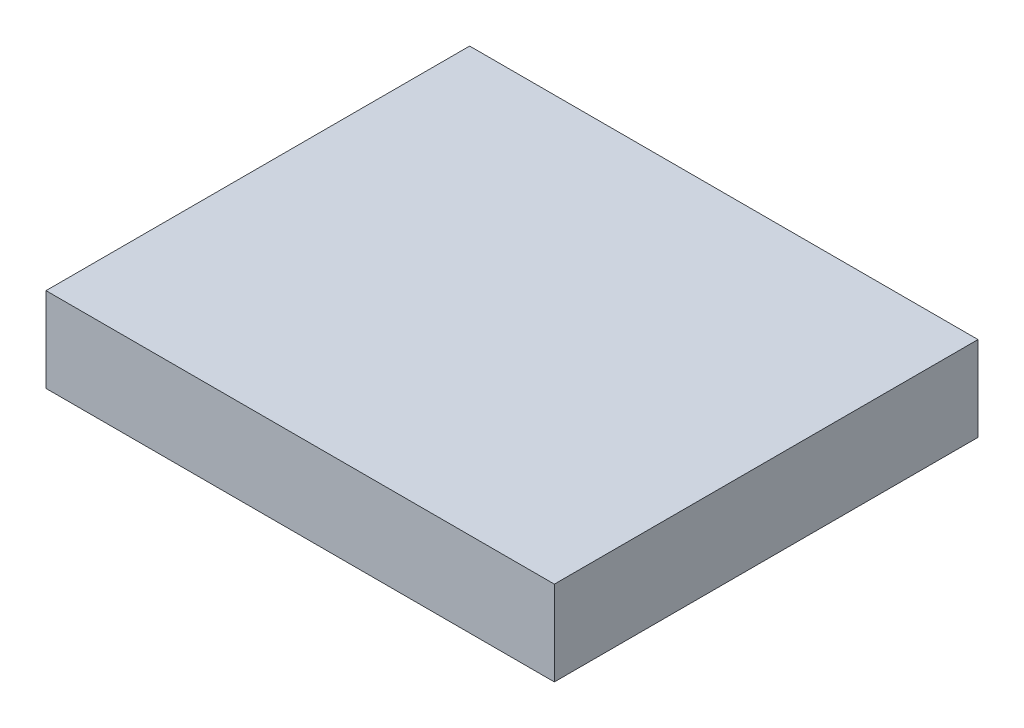
ISO-10303-21;
HEADER;
FILE_DESCRIPTION(('STEP AP214'),'2;1');
FILE_NAME('part.step','',(''),(''),'','','');
FILE_SCHEMA(('AUTOMOTIVE_DESIGN { 1 0 10303 214 1 1 1 1 }'));
ENDSEC;
DATA;
#1=APPLICATION_CONTEXT('core data for automotive mechanical design processes');
#2=APPLICATION_PROTOCOL_DEFINITION('international standard','automotive_design',2000,#1);
#3=PRODUCT_CONTEXT('',#1,'mechanical');
#4=PRODUCT('Part','Part','',(#3));
#5=PRODUCT_RELATED_PRODUCT_CATEGORY('part','',(#4));
#6=PRODUCT_DEFINITION_FORMATION('','',#4);
#7=PRODUCT_DEFINITION_CONTEXT('part definition',#1,'design');
#8=PRODUCT_DEFINITION('design','',#6,#7);
#9=PRODUCT_DEFINITION_SHAPE('','',#8);
#10=(LENGTH_UNIT() NAMED_UNIT(*) SI_UNIT(.MILLI.,.METRE.));
#11=(NAMED_UNIT(*) PLANE_ANGLE_UNIT() SI_UNIT($,.RADIAN.));
#12=(NAMED_UNIT(*) SI_UNIT($,.STERADIAN.) SOLID_ANGLE_UNIT());
#13=UNCERTAINTY_MEASURE_WITH_UNIT(LENGTH_MEASURE(1.E-05),#10,'distance_accuracy_value','');
#14=(GEOMETRIC_REPRESENTATION_CONTEXT(3) GLOBAL_UNCERTAINTY_ASSIGNED_CONTEXT((#13)) GLOBAL_UNIT_ASSIGNED_CONTEXT((#10,
#11,#12)) REPRESENTATION_CONTEXT('',''));
#15=CARTESIAN_POINT('',(0.,0.,0.));
#16=DIRECTION('',(0.,0.,1.));
#17=DIRECTION('',(1.,0.,0.));
#18=AXIS2_PLACEMENT_3D('',#15,#16,#17);
#19=CARTESIAN_POINT('',(0.3,0.28,0.25));
#20=DIRECTION('',(-1.,0.,0.));
#21=DIRECTION('',(0.,0.707106781186548,0.707106781186548));
#22=AXIS2_PLACEMENT_3D('',#19,#20,#21);
#23=PLANE('',#22);
#24=DIRECTION('',(0.,0.,-1.));
#25=VECTOR('',#24,1.);
#26=CARTESIAN_POINT('',(0.3,0.18,0.25));
#27=LINE('',#26,#25);
#28=CARTESIAN_POINT('',(0.3,0.18,0.25));
#29=VERTEX_POINT('',#28);
#30=CARTESIAN_POINT('',(0.3,0.18,-0.25));
#31=VERTEX_POINT('',#30);
#32=EDGE_CURVE('E11',#29,#31,#27,.T.);
#33=ORIENTED_EDGE('',*,*,#32,.T.);
#34=DIRECTION('',(0.,-1.,0.));
#35=VECTOR('',#34,1.);
#36=CARTESIAN_POINT('',(0.3,0.28,-0.25));
#37=LINE('',#36,#35);
#38=CARTESIAN_POINT('',(0.3,0.28,-0.25));
#39=VERTEX_POINT('',#38);
#40=EDGE_CURVE('E35',#39,#31,#37,.T.);
#41=ORIENTED_EDGE('',*,*,#40,.F.);
#42=DIRECTION('',(0.,0.,-1.));
#43=VECTOR('',#42,1.);
#44=CARTESIAN_POINT('',(0.3,0.28,0.25));
#45=LINE('',#44,#43);
#46=CARTESIAN_POINT('',(0.3,0.28,0.25));
#47=VERTEX_POINT('',#46);
#48=EDGE_CURVE('E72',#47,#39,#45,.T.);
#49=ORIENTED_EDGE('',*,*,#48,.F.);
#50=DIRECTION('',(0.,-1.,0.));
#51=VECTOR('',#50,1.);
#52=CARTESIAN_POINT('',(0.3,0.28,0.25));
#53=LINE('',#52,#51);
#54=EDGE_CURVE('E26',#47,#29,#53,.T.);
#55=ORIENTED_EDGE('',*,*,#54,.T.);
#56=EDGE_LOOP('',(#33,#41,#49,#55));
#57=FACE_BOUND('',#56,.T.);
#58=ADVANCED_FACE('F16',(#57),#23,.F.);
#59=CARTESIAN_POINT('',(-0.3,0.28,-0.25));
#60=DIRECTION('',(0.,0.,1.));
#61=DIRECTION('',(0.707106781186548,0.707106781186548,0.));
#62=AXIS2_PLACEMENT_3D('',#59,#60,#61);
#63=PLANE('',#62);
#64=DIRECTION('',(-1.,0.,0.));
#65=VECTOR('',#64,1.);
#66=CARTESIAN_POINT('',(-0.3,0.18,-0.25));
#67=LINE('',#66,#65);
#68=CARTESIAN_POINT('',(-0.3,0.18,-0.25));
#69=VERTEX_POINT('',#68);
#70=EDGE_CURVE('E79',#31,#69,#67,.T.);
#71=ORIENTED_EDGE('',*,*,#70,.T.);
#72=DIRECTION('',(0.,-1.,0.));
#73=VECTOR('',#72,1.);
#74=CARTESIAN_POINT('',(-0.3,0.28,-0.25));
#75=LINE('',#74,#73);
#76=CARTESIAN_POINT('',(-0.3,0.28,-0.25));
#77=VERTEX_POINT('',#76);
#78=EDGE_CURVE('E85',#77,#69,#75,.T.);
#79=ORIENTED_EDGE('',*,*,#78,.F.);
#80=DIRECTION('',(-1.,0.,0.));
#81=VECTOR('',#80,1.);
#82=CARTESIAN_POINT('',(-0.3,0.28,-0.25));
#83=LINE('',#82,#81);
#84=EDGE_CURVE('E63',#39,#77,#83,.T.);
#85=ORIENTED_EDGE('',*,*,#84,.F.);
#86=ORIENTED_EDGE('',*,*,#40,.T.);
#87=EDGE_LOOP('',(#71,#79,#85,#86));
#88=FACE_BOUND('',#87,.T.);
#89=ADVANCED_FACE('F89',(#88),#63,.F.);
#90=CARTESIAN_POINT('',(-0.3,0.28,0.25));
#91=DIRECTION('',(1.,0.,0.));
#92=DIRECTION('',(0.,0.707106781186548,0.707106781186548));
#93=AXIS2_PLACEMENT_3D('',#90,#91,#92);
#94=PLANE('',#93);
#95=DIRECTION('',(0.,0.,1.));
#96=VECTOR('',#95,1.);
#97=CARTESIAN_POINT('',(-0.3,0.18,0.25));
#98=LINE('',#97,#96);
#99=CARTESIAN_POINT('',(-0.3,0.18,0.25));
#100=VERTEX_POINT('',#99);
#101=EDGE_CURVE('E69',#69,#100,#98,.T.);
#102=ORIENTED_EDGE('',*,*,#101,.T.);
#103=DIRECTION('',(0.,-1.,0.));
#104=VECTOR('',#103,1.);
#105=CARTESIAN_POINT('',(-0.3,0.28,0.25));
#106=LINE('',#105,#104);
#107=CARTESIAN_POINT('',(-0.3,0.28,0.25));
#108=VERTEX_POINT('',#107);
#109=EDGE_CURVE('E55',#108,#100,#106,.T.);
#110=ORIENTED_EDGE('',*,*,#109,.F.);
#111=DIRECTION('',(0.,0.,1.));
#112=VECTOR('',#111,1.);
#113=CARTESIAN_POINT('',(-0.3,0.28,0.25));
#114=LINE('',#113,#112);
#115=EDGE_CURVE('E61',#77,#108,#114,.T.);
#116=ORIENTED_EDGE('',*,*,#115,.F.);
#117=ORIENTED_EDGE('',*,*,#78,.T.);
#118=EDGE_LOOP('',(#102,#110,#116,#117));
#119=FACE_BOUND('',#118,.T.);
#120=ADVANCED_FACE('F67',(#119),#94,.F.);
#121=CARTESIAN_POINT('',(-0.3,0.28,0.25));
#122=DIRECTION('',(0.,0.,-1.));
#123=DIRECTION('',(0.707106781186548,0.707106781186548,0.));
#124=AXIS2_PLACEMENT_3D('',#121,#122,#123);
#125=PLANE('',#124);
#126=DIRECTION('',(1.,0.,0.));
#127=VECTOR('',#126,1.);
#128=CARTESIAN_POINT('',(-0.3,0.18,0.25));
#129=LINE('',#128,#127);
#130=EDGE_CURVE('E71',#100,#29,#129,.T.);
#131=ORIENTED_EDGE('',*,*,#130,.T.);
#132=ORIENTED_EDGE('',*,*,#54,.F.);
#133=DIRECTION('',(1.,0.,0.));
#134=VECTOR('',#133,1.);
#135=CARTESIAN_POINT('',(-0.3,0.28,0.25));
#136=LINE('',#135,#134);
#137=EDGE_CURVE('E20',#108,#47,#136,.T.);
#138=ORIENTED_EDGE('',*,*,#137,.F.);
#139=ORIENTED_EDGE('',*,*,#109,.T.);
#140=EDGE_LOOP('',(#131,#132,#138,#139));
#141=FACE_BOUND('',#140,.T.);
#142=ADVANCED_FACE('F75',(#141),#125,.F.);
#143=CARTESIAN_POINT('',(0.,0.28,0.));
#144=DIRECTION('',(0.,-1.,0.));
#145=DIRECTION('',(0.707106781186548,0.,0.707106781186548));
#146=AXIS2_PLACEMENT_3D('',#143,#144,#145);
#147=PLANE('',#146);
#148=ORIENTED_EDGE('',*,*,#48,.T.);
#149=ORIENTED_EDGE('',*,*,#84,.T.);
#150=ORIENTED_EDGE('',*,*,#115,.T.);
#151=ORIENTED_EDGE('',*,*,#137,.T.);
#152=EDGE_LOOP('',(#148,#149,#150,#151));
#153=FACE_BOUND('',#152,.T.);
#154=ADVANCED_FACE('F62',(#153),#147,.F.);
#155=CARTESIAN_POINT('',(0.,0.18,0.));
#156=DIRECTION('',(0.,-1.,0.));
#157=DIRECTION('',(0.707106781186548,0.,0.707106781186548));
#158=AXIS2_PLACEMENT_3D('',#155,#156,#157);
#159=PLANE('',#158);
#160=ORIENTED_EDGE('',*,*,#32,.F.);
#161=ORIENTED_EDGE('',*,*,#130,.F.);
#162=ORIENTED_EDGE('',*,*,#101,.F.);
#163=ORIENTED_EDGE('',*,*,#70,.F.);
#164=EDGE_LOOP('',(#160,#161,#162,#163));
#165=FACE_BOUND('',#164,.T.);
#166=ADVANCED_FACE('F18',(#165),#159,.T.);
#167=CLOSED_SHELL('',(#58,#89,#120,#142,#154,#166));
#168=MANIFOLD_SOLID_BREP('B1',#167);
#169=ADVANCED_BREP_SHAPE_REPRESENTATION('',(#18,#168),#14);
#170=SHAPE_DEFINITION_REPRESENTATION(#9,#169);
ENDSEC;
END-ISO-10303-21;
